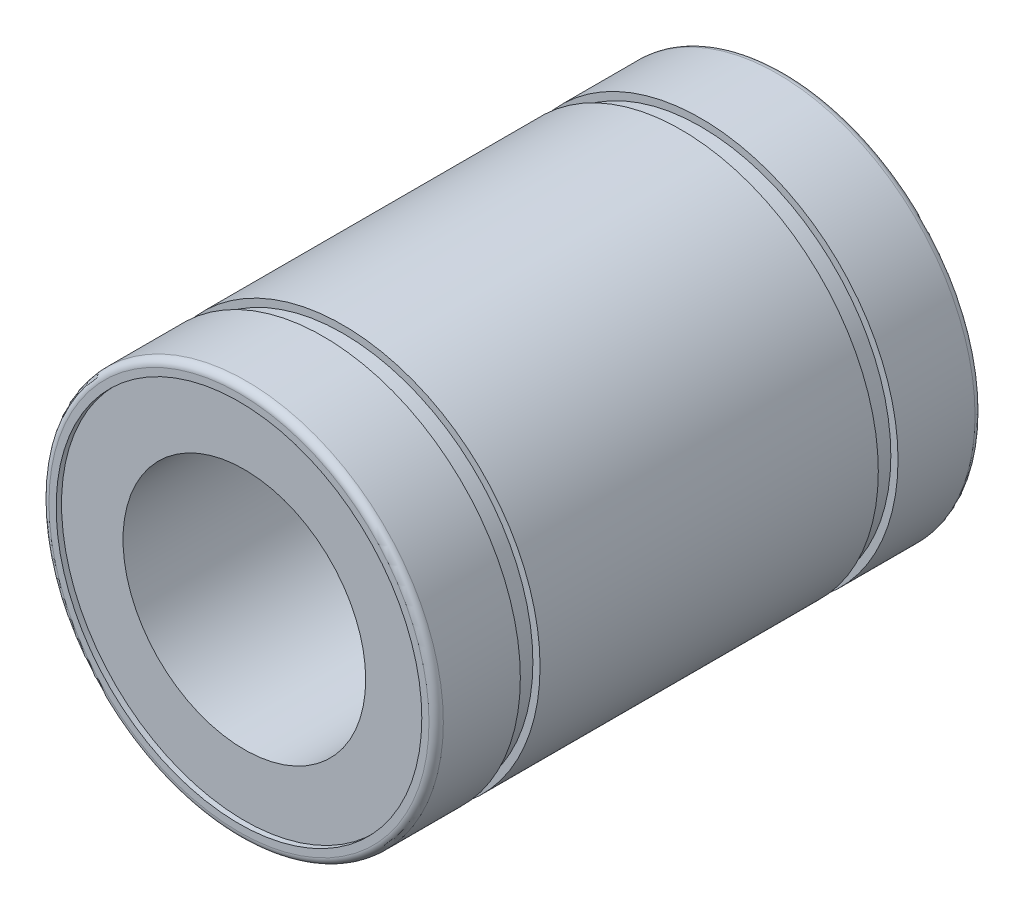
ISO-10303-21;
HEADER;
FILE_DESCRIPTION(('STEP AP214'),'2;1');
FILE_NAME('part.step','',(''),(''),'','','');
FILE_SCHEMA(('AUTOMOTIVE_DESIGN { 1 0 10303 214 1 1 1 1 }'));
ENDSEC;
DATA;
#1=APPLICATION_CONTEXT('core data for automotive mechanical design processes');
#2=APPLICATION_PROTOCOL_DEFINITION('international standard','automotive_design',2000,#1);
#3=PRODUCT_CONTEXT('',#1,'mechanical');
#4=PRODUCT('Part','Part','',(#3));
#5=PRODUCT_RELATED_PRODUCT_CATEGORY('part','',(#4));
#6=PRODUCT_DEFINITION_FORMATION('','',#4);
#7=PRODUCT_DEFINITION_CONTEXT('part definition',#1,'design');
#8=PRODUCT_DEFINITION('design','',#6,#7);
#9=PRODUCT_DEFINITION_SHAPE('','',#8);
#10=(LENGTH_UNIT() NAMED_UNIT(*) SI_UNIT(.MILLI.,.METRE.));
#11=(NAMED_UNIT(*) PLANE_ANGLE_UNIT() SI_UNIT($,.RADIAN.));
#12=(NAMED_UNIT(*) SI_UNIT($,.STERADIAN.) SOLID_ANGLE_UNIT());
#13=UNCERTAINTY_MEASURE_WITH_UNIT(LENGTH_MEASURE(1.E-05),#10,'distance_accuracy_value','');
#14=(GEOMETRIC_REPRESENTATION_CONTEXT(3) GLOBAL_UNCERTAINTY_ASSIGNED_CONTEXT((#13)) GLOBAL_UNIT_ASSIGNED_CONTEXT((#10,
#11,#12)) REPRESENTATION_CONTEXT('',''));
#15=CARTESIAN_POINT('',(0.,0.,0.));
#16=DIRECTION('',(0.,0.,1.));
#17=DIRECTION('',(1.,0.,0.));
#18=AXIS2_PLACEMENT_3D('',#15,#16,#17);
#19=CARTESIAN_POINT('',(0.,0.,18.));
#20=DIRECTION('',(0.,0.,1.));
#21=DIRECTION('',(1.,0.,0.));
#22=AXIS2_PLACEMENT_3D('',#19,#20,#21);
#23=CYLINDRICAL_SURFACE('',#22,13.);
#24=CARTESIAN_POINT('',(0.,0.,-11.15));
#25=DIRECTION('',(0.,0.,1.));
#26=DIRECTION('',(1.,0.,0.));
#27=AXIS2_PLACEMENT_3D('',#24,#25,#26);
#28=CIRCLE('',#27,13.);
#29=CARTESIAN_POINT('',(13.,0.,-11.15));
#30=VERTEX_POINT('',#29);
#31=EDGE_CURVE('E74',#30,#30,#28,.T.);
#32=ORIENTED_EDGE('',*,*,#31,.T.);
#33=EDGE_LOOP('',(#32));
#34=FACE_BOUND('',#33,.T.);
#35=CARTESIAN_POINT('',(0.,0.,11.15));
#36=DIRECTION('',(0.,0.,1.));
#37=DIRECTION('',(1.,0.,0.));
#38=AXIS2_PLACEMENT_3D('',#35,#36,#37);
#39=CIRCLE('',#38,13.);
#40=CARTESIAN_POINT('',(13.,0.,11.15));
#41=VERTEX_POINT('',#40);
#42=EDGE_CURVE('E83',#41,#41,#39,.T.);
#43=ORIENTED_EDGE('',*,*,#42,.F.);
#44=EDGE_LOOP('',(#43));
#45=FACE_BOUND('',#44,.T.);
#46=ADVANCED_FACE('F33',(#34,#45),#23,.T.);
#47=CARTESIAN_POINT('',(0.,0.,17.5268386954539));
#48=DIRECTION('',(0.,0.,1.));
#49=DIRECTION('',(1.,0.,0.));
#50=AXIS2_PLACEMENT_3D('',#47,#48,#49);
#51=CIRCLE('',#50,13.);
#52=CARTESIAN_POINT('',(13.,0.,17.5268386954539));
#53=VERTEX_POINT('',#52);
#54=EDGE_CURVE('E59',#53,#53,#51,.T.);
#55=ORIENTED_EDGE('',*,*,#54,.F.);
#56=EDGE_LOOP('',(#55));
#57=FACE_BOUND('',#56,.T.);
#58=CARTESIAN_POINT('',(0.,0.,12.45));
#59=DIRECTION('',(0.,0.,1.));
#60=DIRECTION('',(1.,0.,0.));
#61=AXIS2_PLACEMENT_3D('',#58,#59,#60);
#62=CIRCLE('',#61,13.);
#63=CARTESIAN_POINT('',(13.,0.,12.45));
#64=VERTEX_POINT('',#63);
#65=EDGE_CURVE('E92',#64,#64,#62,.T.);
#66=ORIENTED_EDGE('',*,*,#65,.T.);
#67=EDGE_LOOP('',(#66));
#68=FACE_BOUND('',#67,.T.);
#69=ADVANCED_FACE('F96',(#57,#68),#23,.T.);
#70=CARTESIAN_POINT('',(0.,0.,-17.5268386954539));
#71=DIRECTION('',(0.,0.,1.));
#72=DIRECTION('',(1.,0.,0.));
#73=AXIS2_PLACEMENT_3D('',#70,#71,#72);
#74=CIRCLE('',#73,13.);
#75=CARTESIAN_POINT('',(13.,0.,-17.5268386954539));
#76=VERTEX_POINT('',#75);
#77=EDGE_CURVE('E56',#76,#76,#74,.T.);
#78=ORIENTED_EDGE('',*,*,#77,.T.);
#79=EDGE_LOOP('',(#78));
#80=FACE_BOUND('',#79,.T.);
#81=CARTESIAN_POINT('',(0.,0.,-12.45));
#82=DIRECTION('',(0.,0.,1.));
#83=DIRECTION('',(1.,0.,0.));
#84=AXIS2_PLACEMENT_3D('',#81,#82,#83);
#85=CIRCLE('',#84,13.);
#86=CARTESIAN_POINT('',(13.,0.,-12.45));
#87=VERTEX_POINT('',#86);
#88=EDGE_CURVE('E77',#87,#87,#85,.T.);
#89=ORIENTED_EDGE('',*,*,#88,.F.);
#90=EDGE_LOOP('',(#89));
#91=FACE_BOUND('',#90,.T.);
#92=ADVANCED_FACE('F112',(#80,#91),#23,.T.);
#93=CARTESIAN_POINT('',(0.,8.,17.6453491827042));
#94=DIRECTION('',(0.,0.,-1.));
#95=DIRECTION('',(-1.,0.,0.));
#96=AXIS2_PLACEMENT_3D('',#93,#94,#95);
#97=PLANE('',#96);
#98=CARTESIAN_POINT('',(0.,0.,17.6453491827042));
#99=DIRECTION('',(0.,0.,1.));
#100=DIRECTION('',(1.,0.,0.));
#101=AXIS2_PLACEMENT_3D('',#98,#99,#100);
#102=CIRCLE('',#101,8.);
#103=CARTESIAN_POINT('',(8.,0.,17.6453491827042));
#104=VERTEX_POINT('',#103);
#105=EDGE_CURVE('E10',#104,#104,#102,.T.);
#106=ORIENTED_EDGE('',*,*,#105,.F.);
#107=EDGE_LOOP('',(#106));
#108=FACE_BOUND('',#107,.T.);
#109=CARTESIAN_POINT('',(0.,0.,17.6453491827042));
#110=DIRECTION('',(0.,0.,1.));
#111=DIRECTION('',(1.,0.,0.));
#112=AXIS2_PLACEMENT_3D('',#109,#110,#111);
#113=CIRCLE('',#112,12.0536773909079);
#114=CARTESIAN_POINT('',(12.0536773909079,0.,17.6453491827042));
#115=VERTEX_POINT('',#114);
#116=EDGE_CURVE('E68',#115,#115,#113,.T.);
#117=ORIENTED_EDGE('',*,*,#116,.T.);
#118=EDGE_LOOP('',(#117));
#119=FACE_BOUND('',#118,.T.);
#120=ADVANCED_FACE('F35',(#108,#119),#97,.F.);
#121=CARTESIAN_POINT('',(0.,0.,18.));
#122=DIRECTION('',(0.,0.,1.));
#123=DIRECTION('',(1.,0.,0.));
#124=AXIS2_PLACEMENT_3D('',#121,#122,#123);
#125=CYLINDRICAL_SURFACE('',#124,8.);
#126=CARTESIAN_POINT('',(0.,0.,-17.6453491827042));
#127=DIRECTION('',(0.,0.,1.));
#128=DIRECTION('',(1.,0.,0.));
#129=AXIS2_PLACEMENT_3D('',#126,#127,#128);
#130=CIRCLE('',#129,8.);
#131=CARTESIAN_POINT('',(8.,0.,-17.6453491827042));
#132=VERTEX_POINT('',#131);
#133=EDGE_CURVE('E40',#132,#132,#130,.T.);
#134=ORIENTED_EDGE('',*,*,#133,.F.);
#135=EDGE_LOOP('',(#134));
#136=FACE_BOUND('',#135,.T.);
#137=ORIENTED_EDGE('',*,*,#105,.T.);
#138=EDGE_LOOP('',(#137));
#139=FACE_BOUND('',#138,.T.);
#140=ADVANCED_FACE('F125',(#136,#139),#125,.F.);
#141=CARTESIAN_POINT('',(0.,8.,-17.6453491827042));
#142=DIRECTION('',(0.,0.,1.));
#143=DIRECTION('',(1.,0.,0.));
#144=AXIS2_PLACEMENT_3D('',#141,#142,#143);
#145=PLANE('',#144);
#146=CARTESIAN_POINT('',(0.,0.,-17.6453491827042));
#147=DIRECTION('',(0.,0.,1.));
#148=DIRECTION('',(1.,0.,0.));
#149=AXIS2_PLACEMENT_3D('',#146,#147,#148);
#150=CIRCLE('',#149,12.0536773909079);
#151=CARTESIAN_POINT('',(12.0536773909079,0.,-17.6453491827042));
#152=VERTEX_POINT('',#151);
#153=EDGE_CURVE('E44',#152,#152,#150,.T.);
#154=ORIENTED_EDGE('',*,*,#153,.F.);
#155=EDGE_LOOP('',(#154));
#156=FACE_BOUND('',#155,.T.);
#157=ORIENTED_EDGE('',*,*,#133,.T.);
#158=EDGE_LOOP('',(#157));
#159=FACE_BOUND('',#158,.T.);
#160=ADVANCED_FACE('F182',(#156,#159),#145,.F.);
#161=CARTESIAN_POINT('',(0.,0.,18.));
#162=DIRECTION('',(0.,0.,1.));
#163=DIRECTION('',(1.,0.,0.));
#164=AXIS2_PLACEMENT_3D('',#161,#162,#163);
#165=CYLINDRICAL_SURFACE('',#164,12.0536773909079);
#166=CARTESIAN_POINT('',(0.,0.,-18.));
#167=DIRECTION('',(0.,0.,1.));
#168=DIRECTION('',(1.,0.,0.));
#169=AXIS2_PLACEMENT_3D('',#166,#167,#168);
#170=CIRCLE('',#169,12.0536773909079);
#171=CARTESIAN_POINT('',(12.0536773909079,0.,-18.));
#172=VERTEX_POINT('',#171);
#173=EDGE_CURVE('E48',#172,#172,#170,.T.);
#174=ORIENTED_EDGE('',*,*,#173,.F.);
#175=EDGE_LOOP('',(#174));
#176=FACE_BOUND('',#175,.T.);
#177=ORIENTED_EDGE('',*,*,#153,.T.);
#178=EDGE_LOOP('',(#177));
#179=FACE_BOUND('',#178,.T.);
#180=ADVANCED_FACE('F175',(#176,#179),#165,.F.);
#181=CARTESIAN_POINT('',(0.,12.0536773909079,-18.));
#182=DIRECTION('',(0.,0.,1.));
#183=DIRECTION('',(1.,0.,0.));
#184=AXIS2_PLACEMENT_3D('',#181,#182,#183);
#185=PLANE('',#184);
#186=CARTESIAN_POINT('',(0.,0.,-18.));
#187=DIRECTION('',(0.,0.,1.));
#188=DIRECTION('',(1.,0.,0.));
#189=AXIS2_PLACEMENT_3D('',#186,#187,#188);
#190=CIRCLE('',#189,12.5268386954539);
#191=CARTESIAN_POINT('',(12.5268386954539,0.,-18.));
#192=VERTEX_POINT('',#191);
#193=EDGE_CURVE('E53',#192,#192,#190,.T.);
#194=ORIENTED_EDGE('',*,*,#193,.F.);
#195=EDGE_LOOP('',(#194));
#196=FACE_BOUND('',#195,.T.);
#197=ORIENTED_EDGE('',*,*,#173,.T.);
#198=EDGE_LOOP('',(#197));
#199=FACE_BOUND('',#198,.T.);
#200=ADVANCED_FACE('F166',(#196,#199),#185,.F.);
#201=CARTESIAN_POINT('',(0.,0.,-17.5268386954539));
#202=DIRECTION('',(0.,0.,1.));
#203=DIRECTION('',(1.,0.,0.));
#204=AXIS2_PLACEMENT_3D('',#201,#202,#203);
#205=TOROIDAL_SURFACE('',#204,12.5268386954539,0.473161304546068);
#206=ORIENTED_EDGE('',*,*,#77,.F.);
#207=EDGE_LOOP('',(#206));
#208=FACE_BOUND('',#207,.T.);
#209=ORIENTED_EDGE('',*,*,#193,.T.);
#210=EDGE_LOOP('',(#209));
#211=FACE_BOUND('',#210,.T.);
#212=ADVANCED_FACE('F161',(#208,#211),#205,.T.);
#213=CARTESIAN_POINT('',(0.,0.,17.5268386954539));
#214=DIRECTION('',(0.,0.,1.));
#215=DIRECTION('',(1.,0.,0.));
#216=AXIS2_PLACEMENT_3D('',#213,#214,#215);
#217=TOROIDAL_SURFACE('',#216,12.5268386954539,0.473161304546063);
#218=CARTESIAN_POINT('',(0.,0.,18.));
#219=DIRECTION('',(0.,0.,1.));
#220=DIRECTION('',(1.,0.,0.));
#221=AXIS2_PLACEMENT_3D('',#218,#219,#220);
#222=CIRCLE('',#221,12.5268386954539);
#223=CARTESIAN_POINT('',(12.5268386954539,0.,18.));
#224=VERTEX_POINT('',#223);
#225=EDGE_CURVE('E62',#224,#224,#222,.T.);
#226=ORIENTED_EDGE('',*,*,#225,.F.);
#227=EDGE_LOOP('',(#226));
#228=FACE_BOUND('',#227,.T.);
#229=ORIENTED_EDGE('',*,*,#54,.T.);
#230=EDGE_LOOP('',(#229));
#231=FACE_BOUND('',#230,.T.);
#232=ADVANCED_FACE('F158',(#228,#231),#217,.T.);
#233=CARTESIAN_POINT('',(0.,12.0536773909079,18.));
#234=DIRECTION('',(0.,0.,-1.));
#235=DIRECTION('',(-1.,0.,0.));
#236=AXIS2_PLACEMENT_3D('',#233,#234,#235);
#237=PLANE('',#236);
#238=CARTESIAN_POINT('',(0.,0.,18.));
#239=DIRECTION('',(0.,0.,1.));
#240=DIRECTION('',(1.,0.,0.));
#241=AXIS2_PLACEMENT_3D('',#238,#239,#240);
#242=CIRCLE('',#241,12.0536773909079);
#243=CARTESIAN_POINT('',(12.0536773909079,0.,18.));
#244=VERTEX_POINT('',#243);
#245=EDGE_CURVE('E65',#244,#244,#242,.T.);
#246=ORIENTED_EDGE('',*,*,#245,.F.);
#247=EDGE_LOOP('',(#246));
#248=FACE_BOUND('',#247,.T.);
#249=ORIENTED_EDGE('',*,*,#225,.T.);
#250=EDGE_LOOP('',(#249));
#251=FACE_BOUND('',#250,.T.);
#252=ADVANCED_FACE('F155',(#248,#251),#237,.F.);
#253=CARTESIAN_POINT('',(0.,0.,18.));
#254=DIRECTION('',(0.,0.,1.));
#255=DIRECTION('',(1.,0.,0.));
#256=AXIS2_PLACEMENT_3D('',#253,#254,#255);
#257=CYLINDRICAL_SURFACE('',#256,12.0536773909079);
#258=ORIENTED_EDGE('',*,*,#116,.F.);
#259=EDGE_LOOP('',(#258));
#260=FACE_BOUND('',#259,.T.);
#261=ORIENTED_EDGE('',*,*,#245,.T.);
#262=EDGE_LOOP('',(#261));
#263=FACE_BOUND('',#262,.T.);
#264=ADVANCED_FACE('F141',(#260,#263),#257,.F.);
#265=CARTESIAN_POINT('',(0.,0.,18.));
#266=DIRECTION('',(0.,0.,1.));
#267=DIRECTION('',(1.,0.,0.));
#268=AXIS2_PLACEMENT_3D('',#265,#266,#267);
#269=CYLINDRICAL_SURFACE('',#268,12.5268386954539);
#270=CARTESIAN_POINT('',(0.,0.,-12.45));
#271=DIRECTION('',(0.,0.,1.));
#272=DIRECTION('',(1.,0.,0.));
#273=AXIS2_PLACEMENT_3D('',#270,#271,#272);
#274=CIRCLE('',#273,12.5268386954539);
#275=CARTESIAN_POINT('',(12.5268386954539,0.,-12.45));
#276=VERTEX_POINT('',#275);
#277=EDGE_CURVE('E80',#276,#276,#274,.T.);
#278=ORIENTED_EDGE('',*,*,#277,.T.);
#279=EDGE_LOOP('',(#278));
#280=FACE_BOUND('',#279,.T.);
#281=CARTESIAN_POINT('',(0.,0.,-11.15));
#282=DIRECTION('',(0.,0.,1.));
#283=DIRECTION('',(1.,0.,0.));
#284=AXIS2_PLACEMENT_3D('',#281,#282,#283);
#285=CIRCLE('',#284,12.5268386954539);
#286=CARTESIAN_POINT('',(12.5268386954539,0.,-11.15));
#287=VERTEX_POINT('',#286);
#288=EDGE_CURVE('E71',#287,#287,#285,.T.);
#289=ORIENTED_EDGE('',*,*,#288,.F.);
#290=EDGE_LOOP('',(#289));
#291=FACE_BOUND('',#290,.T.);
#292=ADVANCED_FACE('F138',(#280,#291),#269,.T.);
#293=CARTESIAN_POINT('',(0.,13.,-11.15));
#294=DIRECTION('',(0.,0.,-1.));
#295=DIRECTION('',(-1.,0.,0.));
#296=AXIS2_PLACEMENT_3D('',#293,#294,#295);
#297=PLANE('',#296);
#298=ORIENTED_EDGE('',*,*,#288,.T.);
#299=EDGE_LOOP('',(#298));
#300=FACE_BOUND('',#299,.T.);
#301=ORIENTED_EDGE('',*,*,#31,.F.);
#302=EDGE_LOOP('',(#301));
#303=FACE_BOUND('',#302,.T.);
#304=ADVANCED_FACE('F134',(#300,#303),#297,.T.);
#305=CARTESIAN_POINT('',(0.,12.5268386954539,-12.45));
#306=DIRECTION('',(0.,0.,1.));
#307=DIRECTION('',(1.,0.,0.));
#308=AXIS2_PLACEMENT_3D('',#305,#306,#307);
#309=PLANE('',#308);
#310=ORIENTED_EDGE('',*,*,#88,.T.);
#311=EDGE_LOOP('',(#310));
#312=FACE_BOUND('',#311,.T.);
#313=ORIENTED_EDGE('',*,*,#277,.F.);
#314=EDGE_LOOP('',(#313));
#315=FACE_BOUND('',#314,.T.);
#316=ADVANCED_FACE('F131',(#312,#315),#309,.T.);
#317=CARTESIAN_POINT('',(0.,13.,11.15));
#318=DIRECTION('',(0.,0.,1.));
#319=DIRECTION('',(1.,0.,0.));
#320=AXIS2_PLACEMENT_3D('',#317,#318,#319);
#321=PLANE('',#320);
#322=ORIENTED_EDGE('',*,*,#42,.T.);
#323=EDGE_LOOP('',(#322));
#324=FACE_BOUND('',#323,.T.);
#325=CARTESIAN_POINT('',(0.,0.,11.15));
#326=DIRECTION('',(0.,0.,1.));
#327=DIRECTION('',(1.,0.,0.));
#328=AXIS2_PLACEMENT_3D('',#325,#326,#327);
#329=CIRCLE('',#328,12.5268386954539);
#330=CARTESIAN_POINT('',(12.5268386954539,0.,11.15));
#331=VERTEX_POINT('',#330);
#332=EDGE_CURVE('E86',#331,#331,#329,.T.);
#333=ORIENTED_EDGE('',*,*,#332,.F.);
#334=EDGE_LOOP('',(#333));
#335=FACE_BOUND('',#334,.T.);
#336=ADVANCED_FACE('F106',(#324,#335),#321,.T.);
#337=CARTESIAN_POINT('',(0.,0.,18.));
#338=DIRECTION('',(0.,0.,1.));
#339=DIRECTION('',(1.,0.,0.));
#340=AXIS2_PLACEMENT_3D('',#337,#338,#339);
#341=CYLINDRICAL_SURFACE('',#340,12.5268386954539);
#342=ORIENTED_EDGE('',*,*,#332,.T.);
#343=EDGE_LOOP('',(#342));
#344=FACE_BOUND('',#343,.T.);
#345=CARTESIAN_POINT('',(0.,0.,12.45));
#346=DIRECTION('',(0.,0.,1.));
#347=DIRECTION('',(1.,0.,0.));
#348=AXIS2_PLACEMENT_3D('',#345,#346,#347);
#349=CIRCLE('',#348,12.5268386954539);
#350=CARTESIAN_POINT('',(12.5268386954539,0.,12.45));
#351=VERTEX_POINT('',#350);
#352=EDGE_CURVE('E89',#351,#351,#349,.T.);
#353=ORIENTED_EDGE('',*,*,#352,.F.);
#354=EDGE_LOOP('',(#353));
#355=FACE_BOUND('',#354,.T.);
#356=ADVANCED_FACE('F100',(#344,#355),#341,.T.);
#357=CARTESIAN_POINT('',(0.,12.5268386954539,12.45));
#358=DIRECTION('',(0.,0.,-1.));
#359=DIRECTION('',(-1.,0.,0.));
#360=AXIS2_PLACEMENT_3D('',#357,#358,#359);
#361=PLANE('',#360);
#362=ORIENTED_EDGE('',*,*,#352,.T.);
#363=EDGE_LOOP('',(#362));
#364=FACE_BOUND('',#363,.T.);
#365=ORIENTED_EDGE('',*,*,#65,.F.);
#366=EDGE_LOOP('',(#365));
#367=FACE_BOUND('',#366,.T.);
#368=ADVANCED_FACE('F98',(#364,#367),#361,.T.);
#369=CLOSED_SHELL('',(#46,#69,#92,#120,#140,#160,#180,#200,#212,#232,#252,#264,#292,#304,#316,
#336,#356,#368));
#370=MANIFOLD_SOLID_BREP('B2',#369);
#371=ADVANCED_BREP_SHAPE_REPRESENTATION('',(#18,#370),#14);
#372=SHAPE_DEFINITION_REPRESENTATION(#9,#371);
ENDSEC;
END-ISO-10303-21;
